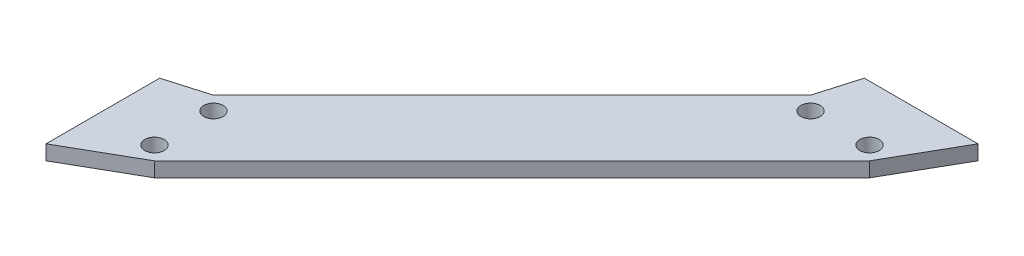
ISO-10303-21;
HEADER;
FILE_DESCRIPTION(('STEP AP214'),'2;1');
FILE_NAME('part.step','',(''),(''),'','','');
FILE_SCHEMA(('AUTOMOTIVE_DESIGN { 1 0 10303 214 1 1 1 1 }'));
ENDSEC;
DATA;
#1=APPLICATION_CONTEXT('core data for automotive mechanical design processes');
#2=APPLICATION_PROTOCOL_DEFINITION('international standard','automotive_design',2000,#1);
#3=PRODUCT_CONTEXT('',#1,'mechanical');
#4=PRODUCT('Part','Part','',(#3));
#5=PRODUCT_RELATED_PRODUCT_CATEGORY('part','',(#4));
#6=PRODUCT_DEFINITION_FORMATION('','',#4);
#7=PRODUCT_DEFINITION_CONTEXT('part definition',#1,'design');
#8=PRODUCT_DEFINITION('design','',#6,#7);
#9=PRODUCT_DEFINITION_SHAPE('','',#8);
#10=(LENGTH_UNIT() NAMED_UNIT(*) SI_UNIT(.MILLI.,.METRE.));
#11=(NAMED_UNIT(*) PLANE_ANGLE_UNIT() SI_UNIT($,.RADIAN.));
#12=(NAMED_UNIT(*) SI_UNIT($,.STERADIAN.) SOLID_ANGLE_UNIT());
#13=UNCERTAINTY_MEASURE_WITH_UNIT(LENGTH_MEASURE(1.E-05),#10,'distance_accuracy_value','');
#14=(GEOMETRIC_REPRESENTATION_CONTEXT(3) GLOBAL_UNCERTAINTY_ASSIGNED_CONTEXT((#13)) GLOBAL_UNIT_ASSIGNED_CONTEXT((#10,
#11,#12)) REPRESENTATION_CONTEXT('',''));
#15=CARTESIAN_POINT('',(0.,0.,0.));
#16=DIRECTION('',(0.,0.,1.));
#17=DIRECTION('',(1.,0.,0.));
#18=AXIS2_PLACEMENT_3D('',#15,#16,#17);
#19=CARTESIAN_POINT('',(0.,3.175,0.));
#20=DIRECTION('',(0.,1.,0.));
#21=DIRECTION('',(0.,0.,1.));
#22=AXIS2_PLACEMENT_3D('',#19,#20,#21);
#23=PLANE('',#22);
#24=CARTESIAN_POINT('',(11.9062499999998,3.175,76.2));
#25=DIRECTION('',(0.,1.,0.));
#26=DIRECTION('',(0.,0.,-1.));
#27=AXIS2_PLACEMENT_3D('',#24,#25,#26);
#28=CIRCLE('',#27,2.08279999999999);
#29=CARTESIAN_POINT('',(11.9062499999998,3.175,74.1172000000001));
#30=VERTEX_POINT('',#29);
#31=EDGE_CURVE('E222',#30,#30,#28,.T.);
#32=ORIENTED_EDGE('',*,*,#31,.F.);
#33=EDGE_LOOP('',(#32));
#34=FACE_BOUND('',#33,.T.);
#35=CARTESIAN_POINT('',(76.2,3.175,11.90625));
#36=DIRECTION('',(0.,1.,0.));
#37=DIRECTION('',(0.,0.,1.));
#38=AXIS2_PLACEMENT_3D('',#35,#36,#37);
#39=CIRCLE('',#38,2.0828);
#40=CARTESIAN_POINT('',(76.2,3.175,13.98905));
#41=VERTEX_POINT('',#40);
#42=EDGE_CURVE('E150',#41,#41,#39,.T.);
#43=ORIENTED_EDGE('',*,*,#42,.F.);
#44=EDGE_LOOP('',(#43));
#45=FACE_BOUND('',#44,.T.);
#46=DIRECTION('',(-1.,0.,0.));
#47=VECTOR('',#46,1.);
#48=CARTESIAN_POINT('',(75.8652019845786,3.175,0.));
#49=LINE('',#48,#47);
#50=CARTESIAN_POINT('',(100.347298015421,3.175,0.));
#51=VERTEX_POINT('',#50);
#52=CARTESIAN_POINT('',(75.8652019845786,3.175,0.));
#53=VERTEX_POINT('',#52);
#54=EDGE_CURVE('E57',#51,#53,#49,.T.);
#55=ORIENTED_EDGE('',*,*,#54,.T.);
#56=DIRECTION('',(-0.279721622371134,0.,0.960081149683744));
#57=VECTOR('',#56,1.);
#58=CARTESIAN_POINT('',(73.2544759922893,3.175,8.96072599228932));
#59=LINE('',#58,#57);
#60=CARTESIAN_POINT('',(73.2544759922893,3.175,8.96072599228932));
#61=VERTEX_POINT('',#60);
#62=EDGE_CURVE('E102',#53,#61,#59,.T.);
#63=ORIENTED_EDGE('',*,*,#62,.T.);
#64=DIRECTION('',(-0.707106781186548,0.,0.707106781186546));
#65=VECTOR('',#64,1.);
#66=CARTESIAN_POINT('',(73.2544759922893,3.175,8.96072599228932));
#67=LINE('',#66,#65);
#68=CARTESIAN_POINT('',(8.96072599228913,3.175,73.2544759922893));
#69=VERTEX_POINT('',#68);
#70=EDGE_CURVE('E189',#61,#69,#67,.T.);
#71=ORIENTED_EDGE('',*,*,#70,.T.);
#72=DIRECTION('',(-0.960081149683745,0.,0.279721622371132));
#73=VECTOR('',#72,1.);
#74=CARTESIAN_POINT('',(8.96072599228913,3.175,73.2544759922893));
#75=LINE('',#74,#73);
#76=CARTESIAN_POINT('',(-1.80411241501588E-13,3.175,75.8652019845786));
#77=VERTEX_POINT('',#76);
#78=EDGE_CURVE('E200',#69,#77,#75,.T.);
#79=ORIENTED_EDGE('',*,*,#78,.T.);
#80=DIRECTION('',(0.,0.,1.));
#81=VECTOR('',#80,1.);
#82=CARTESIAN_POINT('',(-1.80411241501588E-13,3.175,75.8652019845786));
#83=LINE('',#82,#81);
#84=CARTESIAN_POINT('',(-1.80411241501588E-13,3.175,100.347298015421));
#85=VERTEX_POINT('',#84);
#86=EDGE_CURVE('E122',#77,#85,#83,.T.);
#87=ORIENTED_EDGE('',*,*,#86,.T.);
#88=DIRECTION('',(0.86786415082947,0.,-0.496801585851981));
#89=VECTOR('',#88,1.);
#90=CARTESIAN_POINT('',(14.8517740077105,3.175,91.8455240077107));
#91=LINE('',#90,#89);
#92=CARTESIAN_POINT('',(14.8517740077105,3.175,91.8455240077107));
#93=VERTEX_POINT('',#92);
#94=EDGE_CURVE('E116',#85,#93,#91,.T.);
#95=ORIENTED_EDGE('',*,*,#94,.T.);
#96=DIRECTION('',(0.707106781186548,0.,-0.707106781186547));
#97=VECTOR('',#96,1.);
#98=CARTESIAN_POINT('',(91.8455240077107,3.175,14.8517740077107));
#99=LINE('',#98,#97);
#100=CARTESIAN_POINT('',(91.8455240077107,3.175,14.8517740077107));
#101=VERTEX_POINT('',#100);
#102=EDGE_CURVE('E120',#93,#101,#99,.T.);
#103=ORIENTED_EDGE('',*,*,#102,.T.);
#104=DIRECTION('',(0.496801585851982,0.,-0.867864150829469));
#105=VECTOR('',#104,1.);
#106=CARTESIAN_POINT('',(91.8455240077107,3.175,14.8517740077107));
#107=LINE('',#106,#105);
#108=EDGE_CURVE('E139',#101,#51,#107,.T.);
#109=ORIENTED_EDGE('',*,*,#108,.T.);
#110=EDGE_LOOP('',(#55,#63,#71,#79,#87,#95,#103,#109));
#111=FACE_BOUND('',#110,.T.);
#112=CARTESIAN_POINT('',(88.9,3.175,11.90625));
#113=DIRECTION('',(0.,1.,0.));
#114=DIRECTION('',(0.,0.,1.));
#115=AXIS2_PLACEMENT_3D('',#112,#113,#114);
#116=CIRCLE('',#115,2.0828);
#117=CARTESIAN_POINT('',(88.9,3.175,13.98905));
#118=VERTEX_POINT('',#117);
#119=EDGE_CURVE('E214',#118,#118,#116,.T.);
#120=ORIENTED_EDGE('',*,*,#119,.F.);
#121=EDGE_LOOP('',(#120));
#122=FACE_BOUND('',#121,.T.);
#123=CARTESIAN_POINT('',(11.9062499999998,3.175,88.9000000000001));
#124=DIRECTION('',(0.,1.,0.));
#125=DIRECTION('',(0.,0.,-1.));
#126=AXIS2_PLACEMENT_3D('',#123,#124,#125);
#127=CIRCLE('',#126,2.0828);
#128=CARTESIAN_POINT('',(11.9062499999998,3.175,86.8172000000001));
#129=VERTEX_POINT('',#128);
#130=EDGE_CURVE('E230',#129,#129,#127,.T.);
#131=ORIENTED_EDGE('',*,*,#130,.F.);
#132=EDGE_LOOP('',(#131));
#133=FACE_BOUND('',#132,.T.);
#134=ADVANCED_FACE('F39',(#34,#45,#111,#122,#133),#23,.T.);
#135=CARTESIAN_POINT('',(0.,0.,0.));
#136=DIRECTION('',(0.,1.,0.));
#137=DIRECTION('',(0.,0.,1.));
#138=AXIS2_PLACEMENT_3D('',#135,#136,#137);
#139=PLANE('',#138);
#140=DIRECTION('',(-0.279721622371134,0.,0.960081149683744));
#141=VECTOR('',#140,1.);
#142=CARTESIAN_POINT('',(73.2544759922893,0.,8.96072599228932));
#143=LINE('',#142,#141);
#144=CARTESIAN_POINT('',(75.8652019845786,0.,0.));
#145=VERTEX_POINT('',#144);
#146=CARTESIAN_POINT('',(73.2544759922893,0.,8.96072599228932));
#147=VERTEX_POINT('',#146);
#148=EDGE_CURVE('E146',#145,#147,#143,.T.);
#149=ORIENTED_EDGE('',*,*,#148,.F.);
#150=DIRECTION('',(-1.,0.,0.));
#151=VECTOR('',#150,1.);
#152=CARTESIAN_POINT('',(76.2,0.,0.));
#153=LINE('',#152,#151);
#154=CARTESIAN_POINT('',(100.347298015421,0.,0.));
#155=VERTEX_POINT('',#154);
#156=EDGE_CURVE('E94',#155,#145,#153,.T.);
#157=ORIENTED_EDGE('',*,*,#156,.F.);
#158=DIRECTION('',(0.496801585851982,0.,-0.867864150829469));
#159=VECTOR('',#158,1.);
#160=CARTESIAN_POINT('',(91.8455240077107,0.,14.8517740077107));
#161=LINE('',#160,#159);
#162=CARTESIAN_POINT('',(91.8455240077107,0.,14.8517740077107));
#163=VERTEX_POINT('',#162);
#164=EDGE_CURVE('E164',#163,#155,#161,.T.);
#165=ORIENTED_EDGE('',*,*,#164,.F.);
#166=DIRECTION('',(0.707106781186548,0.,-0.707106781186547));
#167=VECTOR('',#166,1.);
#168=CARTESIAN_POINT('',(91.8455240077107,0.,14.8517740077107));
#169=LINE('',#168,#167);
#170=CARTESIAN_POINT('',(14.8517740077105,0.,91.8455240077107));
#171=VERTEX_POINT('',#170);
#172=EDGE_CURVE('E87',#171,#163,#169,.T.);
#173=ORIENTED_EDGE('',*,*,#172,.F.);
#174=DIRECTION('',(0.86786415082947,0.,-0.496801585851981));
#175=VECTOR('',#174,1.);
#176=CARTESIAN_POINT('',(14.8517740077105,0.,91.8455240077107));
#177=LINE('',#176,#175);
#178=CARTESIAN_POINT('',(-1.80411241501588E-13,0.,100.347298015421));
#179=VERTEX_POINT('',#178);
#180=EDGE_CURVE('E131',#179,#171,#177,.T.);
#181=ORIENTED_EDGE('',*,*,#180,.F.);
#182=DIRECTION('',(0.,0.,1.));
#183=VECTOR('',#182,1.);
#184=CARTESIAN_POINT('',(-1.80411241501588E-13,0.,100.347298015421));
#185=LINE('',#184,#183);
#186=CARTESIAN_POINT('',(-1.80411241501588E-13,0.,75.8652019845786));
#187=VERTEX_POINT('',#186);
#188=EDGE_CURVE('E157',#187,#179,#185,.T.);
#189=ORIENTED_EDGE('',*,*,#188,.F.);
#190=DIRECTION('',(-0.960081149683745,0.,0.279721622371132));
#191=VECTOR('',#190,1.);
#192=CARTESIAN_POINT('',(8.96072599228913,0.,73.2544759922893));
#193=LINE('',#192,#191);
#194=CARTESIAN_POINT('',(8.96072599228913,0.,73.2544759922893));
#195=VERTEX_POINT('',#194);
#196=EDGE_CURVE('E153',#195,#187,#193,.T.);
#197=ORIENTED_EDGE('',*,*,#196,.F.);
#198=DIRECTION('',(-0.707106781186548,0.,0.707106781186546));
#199=VECTOR('',#198,1.);
#200=CARTESIAN_POINT('',(73.2544759922893,0.,8.96072599228932));
#201=LINE('',#200,#199);
#202=EDGE_CURVE('E149',#147,#195,#201,.T.);
#203=ORIENTED_EDGE('',*,*,#202,.F.);
#204=EDGE_LOOP('',(#149,#157,#165,#173,#181,#189,#197,#203));
#205=FACE_BOUND('',#204,.T.);
#206=CARTESIAN_POINT('',(76.2,0.,11.90625));
#207=DIRECTION('',(0.,1.,0.));
#208=DIRECTION('',(0.,0.,1.));
#209=AXIS2_PLACEMENT_3D('',#206,#207,#208);
#210=CIRCLE('',#209,2.0828);
#211=CARTESIAN_POINT('',(76.2,0.,13.98905));
#212=VERTEX_POINT('',#211);
#213=EDGE_CURVE('E210',#212,#212,#210,.T.);
#214=ORIENTED_EDGE('',*,*,#213,.T.);
#215=EDGE_LOOP('',(#214));
#216=FACE_BOUND('',#215,.T.);
#217=CARTESIAN_POINT('',(88.9,0.,11.90625));
#218=DIRECTION('',(0.,1.,0.));
#219=DIRECTION('',(0.,0.,1.));
#220=AXIS2_PLACEMENT_3D('',#217,#218,#219);
#221=CIRCLE('',#220,2.0828);
#222=CARTESIAN_POINT('',(88.9,0.,13.98905));
#223=VERTEX_POINT('',#222);
#224=EDGE_CURVE('E218',#223,#223,#221,.T.);
#225=ORIENTED_EDGE('',*,*,#224,.T.);
#226=EDGE_LOOP('',(#225));
#227=FACE_BOUND('',#226,.T.);
#228=CARTESIAN_POINT('',(11.9062499999998,0.,76.2));
#229=DIRECTION('',(0.,1.,0.));
#230=DIRECTION('',(0.,0.,-1.));
#231=AXIS2_PLACEMENT_3D('',#228,#229,#230);
#232=CIRCLE('',#231,2.08279999999999);
#233=CARTESIAN_POINT('',(11.9062499999998,0.,74.1172000000001));
#234=VERTEX_POINT('',#233);
#235=EDGE_CURVE('E226',#234,#234,#232,.T.);
#236=ORIENTED_EDGE('',*,*,#235,.T.);
#237=EDGE_LOOP('',(#236));
#238=FACE_BOUND('',#237,.T.);
#239=CARTESIAN_POINT('',(11.9062499999998,0.,88.9000000000001));
#240=DIRECTION('',(0.,1.,0.));
#241=DIRECTION('',(0.,0.,-1.));
#242=AXIS2_PLACEMENT_3D('',#239,#240,#241);
#243=CIRCLE('',#242,2.0828);
#244=CARTESIAN_POINT('',(11.9062499999998,0.,86.8172000000001));
#245=VERTEX_POINT('',#244);
#246=EDGE_CURVE('E234',#245,#245,#243,.T.);
#247=ORIENTED_EDGE('',*,*,#246,.T.);
#248=EDGE_LOOP('',(#247));
#249=FACE_BOUND('',#248,.T.);
#250=ADVANCED_FACE('F191',(#205,#216,#227,#238,#249),#139,.F.);
#251=CARTESIAN_POINT('',(73.2544759922893,3.175,8.96072599228932));
#252=DIRECTION('',(0.960081149683744,0.,0.279721622371134));
#253=DIRECTION('',(0.279721622371134,0.,-0.960081149683744));
#254=AXIS2_PLACEMENT_3D('',#251,#252,#253);
#255=PLANE('',#254);
#256=ORIENTED_EDGE('',*,*,#148,.T.);
#257=DIRECTION('',(0.,-1.,0.));
#258=VECTOR('',#257,1.);
#259=CARTESIAN_POINT('',(73.2544759922893,3.175,8.96072599228932));
#260=LINE('',#259,#258);
#261=EDGE_CURVE('E49',#61,#147,#260,.T.);
#262=ORIENTED_EDGE('',*,*,#261,.F.);
#263=ORIENTED_EDGE('',*,*,#62,.F.);
#264=DIRECTION('',(0.,-1.,0.));
#265=VECTOR('',#264,1.);
#266=CARTESIAN_POINT('',(75.8652019845786,3.175,0.));
#267=LINE('',#266,#265);
#268=EDGE_CURVE('E11',#53,#145,#267,.T.);
#269=ORIENTED_EDGE('',*,*,#268,.T.);
#270=EDGE_LOOP('',(#256,#262,#263,#269));
#271=FACE_BOUND('',#270,.T.);
#272=ADVANCED_FACE('F41',(#271),#255,.F.);
#273=CARTESIAN_POINT('',(73.2544759922893,3.175,8.96072599228932));
#274=DIRECTION('',(0.707106781186547,0.,0.707106781186548));
#275=DIRECTION('',(0.707106781186548,0.,-0.707106781186547));
#276=AXIS2_PLACEMENT_3D('',#273,#274,#275);
#277=PLANE('',#276);
#278=ORIENTED_EDGE('',*,*,#202,.T.);
#279=DIRECTION('',(0.,-1.,0.));
#280=VECTOR('',#279,1.);
#281=CARTESIAN_POINT('',(8.96072599228913,3.175,73.2544759922893));
#282=LINE('',#281,#280);
#283=EDGE_CURVE('E179',#69,#195,#282,.T.);
#284=ORIENTED_EDGE('',*,*,#283,.F.);
#285=ORIENTED_EDGE('',*,*,#70,.F.);
#286=ORIENTED_EDGE('',*,*,#261,.T.);
#287=EDGE_LOOP('',(#278,#284,#285,#286));
#288=FACE_BOUND('',#287,.T.);
#289=ADVANCED_FACE('F187',(#288),#277,.F.);
#290=CARTESIAN_POINT('',(8.96072599228913,3.175,73.2544759922893));
#291=DIRECTION('',(0.279721622371132,0.,0.960081149683745));
#292=DIRECTION('',(0.960081149683745,0.,-0.279721622371132));
#293=AXIS2_PLACEMENT_3D('',#290,#291,#292);
#294=PLANE('',#293);
#295=ORIENTED_EDGE('',*,*,#196,.T.);
#296=DIRECTION('',(0.,-1.,0.));
#297=VECTOR('',#296,1.);
#298=CARTESIAN_POINT('',(-1.80411241501588E-13,3.175,75.8652019845786));
#299=LINE('',#298,#297);
#300=EDGE_CURVE('E175',#77,#187,#299,.T.);
#301=ORIENTED_EDGE('',*,*,#300,.F.);
#302=ORIENTED_EDGE('',*,*,#78,.F.);
#303=ORIENTED_EDGE('',*,*,#283,.T.);
#304=EDGE_LOOP('',(#295,#301,#302,#303));
#305=FACE_BOUND('',#304,.T.);
#306=ADVANCED_FACE('F195',(#305),#294,.F.);
#307=CARTESIAN_POINT('',(-1.80411241501588E-13,3.175,100.347298015421));
#308=DIRECTION('',(1.,0.,0.));
#309=DIRECTION('',(0.,0.,-1.));
#310=AXIS2_PLACEMENT_3D('',#307,#308,#309);
#311=PLANE('',#310);
#312=ORIENTED_EDGE('',*,*,#188,.T.);
#313=DIRECTION('',(0.,-1.,0.));
#314=VECTOR('',#313,1.);
#315=CARTESIAN_POINT('',(-1.80411241501588E-13,3.175,100.347298015421));
#316=LINE('',#315,#314);
#317=EDGE_CURVE('E133',#85,#179,#316,.T.);
#318=ORIENTED_EDGE('',*,*,#317,.F.);
#319=ORIENTED_EDGE('',*,*,#86,.F.);
#320=ORIENTED_EDGE('',*,*,#300,.T.);
#321=EDGE_LOOP('',(#312,#318,#319,#320));
#322=FACE_BOUND('',#321,.T.);
#323=ADVANCED_FACE('F198',(#322),#311,.F.);
#324=CARTESIAN_POINT('',(14.8517740077105,3.175,91.8455240077107));
#325=DIRECTION('',(-0.496801585851981,0.,-0.86786415082947));
#326=DIRECTION('',(-0.86786415082947,0.,0.496801585851981));
#327=AXIS2_PLACEMENT_3D('',#324,#325,#326);
#328=PLANE('',#327);
#329=ORIENTED_EDGE('',*,*,#180,.T.);
#330=DIRECTION('',(0.,-1.,0.));
#331=VECTOR('',#330,1.);
#332=CARTESIAN_POINT('',(14.8517740077105,3.175,91.8455240077107));
#333=LINE('',#332,#331);
#334=EDGE_CURVE('E128',#93,#171,#333,.T.);
#335=ORIENTED_EDGE('',*,*,#334,.F.);
#336=ORIENTED_EDGE('',*,*,#94,.F.);
#337=ORIENTED_EDGE('',*,*,#317,.T.);
#338=EDGE_LOOP('',(#329,#335,#336,#337));
#339=FACE_BOUND('',#338,.T.);
#340=ADVANCED_FACE('F129',(#339),#328,.F.);
#341=CARTESIAN_POINT('',(91.8455240077107,3.175,14.8517740077107));
#342=DIRECTION('',(-0.707106781186547,0.,-0.707106781186548));
#343=DIRECTION('',(-0.707106781186548,0.,0.707106781186547));
#344=AXIS2_PLACEMENT_3D('',#341,#342,#343);
#345=PLANE('',#344);
#346=ORIENTED_EDGE('',*,*,#172,.T.);
#347=DIRECTION('',(0.,-1.,0.));
#348=VECTOR('',#347,1.);
#349=CARTESIAN_POINT('',(91.8455240077107,3.175,14.8517740077107));
#350=LINE('',#349,#348);
#351=EDGE_CURVE('E134',#101,#163,#350,.T.);
#352=ORIENTED_EDGE('',*,*,#351,.F.);
#353=ORIENTED_EDGE('',*,*,#102,.F.);
#354=ORIENTED_EDGE('',*,*,#334,.T.);
#355=EDGE_LOOP('',(#346,#352,#353,#354));
#356=FACE_BOUND('',#355,.T.);
#357=ADVANCED_FACE('F136',(#356),#345,.F.);
#358=CARTESIAN_POINT('',(91.8455240077107,3.175,14.8517740077107));
#359=DIRECTION('',(-0.867864150829469,0.,-0.496801585851982));
#360=DIRECTION('',(-0.496801585851982,0.,0.867864150829469));
#361=AXIS2_PLACEMENT_3D('',#358,#359,#360);
#362=PLANE('',#361);
#363=ORIENTED_EDGE('',*,*,#164,.T.);
#364=DIRECTION('',(0.,-1.,0.));
#365=VECTOR('',#364,1.);
#366=CARTESIAN_POINT('',(100.347298015421,3.175,0.));
#367=LINE('',#366,#365);
#368=EDGE_CURVE('E142',#51,#155,#367,.T.);
#369=ORIENTED_EDGE('',*,*,#368,.F.);
#370=ORIENTED_EDGE('',*,*,#108,.F.);
#371=ORIENTED_EDGE('',*,*,#351,.T.);
#372=EDGE_LOOP('',(#363,#369,#370,#371));
#373=FACE_BOUND('',#372,.T.);
#374=ADVANCED_FACE('F261',(#373),#362,.F.);
#375=CARTESIAN_POINT('',(76.2,3.175,0.));
#376=DIRECTION('',(0.,0.,1.));
#377=DIRECTION('',(1.,0.,0.));
#378=AXIS2_PLACEMENT_3D('',#375,#376,#377);
#379=PLANE('',#378);
#380=ORIENTED_EDGE('',*,*,#156,.T.);
#381=ORIENTED_EDGE('',*,*,#268,.F.);
#382=ORIENTED_EDGE('',*,*,#54,.F.);
#383=ORIENTED_EDGE('',*,*,#368,.T.);
#384=EDGE_LOOP('',(#380,#381,#382,#383));
#385=FACE_BOUND('',#384,.T.);
#386=ADVANCED_FACE('F258',(#385),#379,.F.);
#387=CARTESIAN_POINT('',(76.2,3.175,11.90625));
#388=DIRECTION('',(0.,-1.,0.));
#389=DIRECTION('',(0.,0.,-1.));
#390=AXIS2_PLACEMENT_3D('',#387,#388,#389);
#391=CYLINDRICAL_SURFACE('',#390,2.0828);
#392=ORIENTED_EDGE('',*,*,#42,.T.);
#393=EDGE_LOOP('',(#392));
#394=FACE_BOUND('',#393,.T.);
#395=ORIENTED_EDGE('',*,*,#213,.F.);
#396=EDGE_LOOP('',(#395));
#397=FACE_BOUND('',#396,.T.);
#398=ADVANCED_FACE('F255',(#394,#397),#391,.F.);
#399=CARTESIAN_POINT('',(88.9,3.175,11.90625));
#400=DIRECTION('',(0.,-1.,0.));
#401=DIRECTION('',(0.,0.,-1.));
#402=AXIS2_PLACEMENT_3D('',#399,#400,#401);
#403=CYLINDRICAL_SURFACE('',#402,2.0828);
#404=ORIENTED_EDGE('',*,*,#119,.T.);
#405=EDGE_LOOP('',(#404));
#406=FACE_BOUND('',#405,.T.);
#407=ORIENTED_EDGE('',*,*,#224,.F.);
#408=EDGE_LOOP('',(#407));
#409=FACE_BOUND('',#408,.T.);
#410=ADVANCED_FACE('F345',(#406,#409),#403,.F.);
#411=CARTESIAN_POINT('',(11.9062499999998,3.175,76.2));
#412=DIRECTION('',(0.,-1.,0.));
#413=DIRECTION('',(0.,0.,-1.));
#414=AXIS2_PLACEMENT_3D('',#411,#412,#413);
#415=CYLINDRICAL_SURFACE('',#414,2.08279999999999);
#416=ORIENTED_EDGE('',*,*,#31,.T.);
#417=EDGE_LOOP('',(#416));
#418=FACE_BOUND('',#417,.T.);
#419=ORIENTED_EDGE('',*,*,#235,.F.);
#420=EDGE_LOOP('',(#419));
#421=FACE_BOUND('',#420,.T.);
#422=ADVANCED_FACE('F353',(#418,#421),#415,.F.);
#423=CARTESIAN_POINT('',(11.9062499999998,3.175,88.9000000000001));
#424=DIRECTION('',(0.,-1.,0.));
#425=DIRECTION('',(0.,0.,-1.));
#426=AXIS2_PLACEMENT_3D('',#423,#424,#425);
#427=CYLINDRICAL_SURFACE('',#426,2.0828);
#428=ORIENTED_EDGE('',*,*,#130,.T.);
#429=EDGE_LOOP('',(#428));
#430=FACE_BOUND('',#429,.T.);
#431=ORIENTED_EDGE('',*,*,#246,.F.);
#432=EDGE_LOOP('',(#431));
#433=FACE_BOUND('',#432,.T.);
#434=ADVANCED_FACE('F242',(#430,#433),#427,.F.);
#435=CLOSED_SHELL('',(#134,#250,#272,#289,#306,#323,#340,#357,#374,#386,#398,#410,#422,#434));
#436=MANIFOLD_SOLID_BREP('B2',#435);
#437=ADVANCED_BREP_SHAPE_REPRESENTATION('',(#18,#436),#14);
#438=SHAPE_DEFINITION_REPRESENTATION(#9,#437);
ENDSEC;
END-ISO-10303-21;
